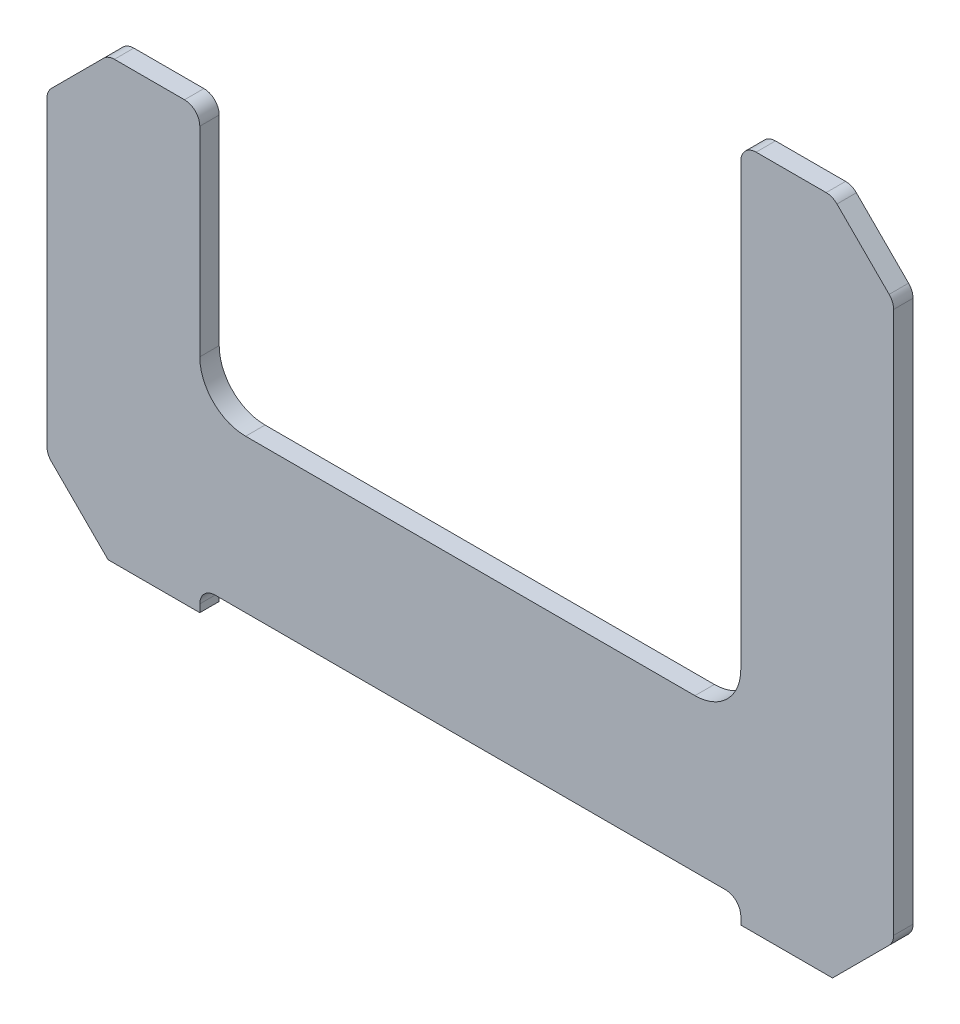
ISO-10303-21;
HEADER;
FILE_DESCRIPTION(('STEP AP214'),'2;1');
FILE_NAME('part.step','',(''),(''),'','','');
FILE_SCHEMA(('AUTOMOTIVE_DESIGN { 1 0 10303 214 1 1 1 1 }'));
ENDSEC;
DATA;
#1=APPLICATION_CONTEXT('core data for automotive mechanical design processes');
#2=APPLICATION_PROTOCOL_DEFINITION('international standard','automotive_design',2000,#1);
#3=PRODUCT_CONTEXT('',#1,'mechanical');
#4=PRODUCT('Part','Part','',(#3));
#5=PRODUCT_RELATED_PRODUCT_CATEGORY('part','',(#4));
#6=PRODUCT_DEFINITION_FORMATION('','',#4);
#7=PRODUCT_DEFINITION_CONTEXT('part definition',#1,'design');
#8=PRODUCT_DEFINITION('design','',#6,#7);
#9=PRODUCT_DEFINITION_SHAPE('','',#8);
#10=(LENGTH_UNIT() NAMED_UNIT(*) SI_UNIT(.MILLI.,.METRE.));
#11=(NAMED_UNIT(*) PLANE_ANGLE_UNIT() SI_UNIT($,.RADIAN.));
#12=(NAMED_UNIT(*) SI_UNIT($,.STERADIAN.) SOLID_ANGLE_UNIT());
#13=UNCERTAINTY_MEASURE_WITH_UNIT(LENGTH_MEASURE(1.E-05),#10,'distance_accuracy_value','');
#14=(GEOMETRIC_REPRESENTATION_CONTEXT(3) GLOBAL_UNCERTAINTY_ASSIGNED_CONTEXT((#13)) GLOBAL_UNIT_ASSIGNED_CONTEXT((#10,
#11,#12)) REPRESENTATION_CONTEXT('',''));
#15=CARTESIAN_POINT('',(0.,0.,0.));
#16=DIRECTION('',(0.,0.,1.));
#17=DIRECTION('',(1.,0.,0.));
#18=AXIS2_PLACEMENT_3D('',#15,#16,#17);
#19=CARTESIAN_POINT('',(-138.5,-57.5,-3.175));
#20=DIRECTION('',(-1.,0.,0.));
#21=DIRECTION('',(0.,0.,1.));
#22=AXIS2_PLACEMENT_3D('',#19,#20,#21);
#23=PLANE('',#22);
#24=DIRECTION('',(0.,-1.,0.));
#25=VECTOR('',#24,1.);
#26=CARTESIAN_POINT('',(-138.5,-57.5,-3.175));
#27=LINE('',#26,#25);
#28=CARTESIAN_POINT('',(-138.5,63.267387760078,-3.175));
#29=VERTEX_POINT('',#28);
#30=CARTESIAN_POINT('',(-138.5,-35.4289321881344,-3.175));
#31=VERTEX_POINT('',#30);
#32=EDGE_CURVE('E270',#29,#31,#27,.T.);
#33=ORIENTED_EDGE('',*,*,#32,.T.);
#34=DIRECTION('',(0.,0.,-1.));
#35=VECTOR('',#34,1.);
#36=CARTESIAN_POINT('',(-138.5,-35.4289321881344,-3.175));
#37=LINE('',#36,#35);
#38=CARTESIAN_POINT('',(-138.5,-35.4289321881344,3.175));
#39=VERTEX_POINT('',#38);
#40=EDGE_CURVE('E395',#31,#39,#37,.F.);
#41=ORIENTED_EDGE('',*,*,#40,.T.);
#42=DIRECTION('',(0.,-1.,0.));
#43=VECTOR('',#42,1.);
#44=CARTESIAN_POINT('',(-138.5,-57.5,3.175));
#45=LINE('',#44,#43);
#46=CARTESIAN_POINT('',(-138.5,63.267387760078,3.175));
#47=VERTEX_POINT('',#46);
#48=EDGE_CURVE('E226',#47,#39,#45,.T.);
#49=ORIENTED_EDGE('',*,*,#48,.F.);
#50=DIRECTION('',(0.,0.,1.));
#51=VECTOR('',#50,1.);
#52=CARTESIAN_POINT('',(-138.5,63.267387760078,-3.175));
#53=LINE('',#52,#51);
#54=EDGE_CURVE('E392',#47,#29,#53,.F.);
#55=ORIENTED_EDGE('',*,*,#54,.T.);
#56=EDGE_LOOP('',(#33,#41,#49,#55));
#57=FACE_BOUND('',#56,.T.);
#58=ADVANCED_FACE('F32',(#57),#23,.T.);
#59=CARTESIAN_POINT('',(-138.5,85.3384555719439,-3.175));
#60=DIRECTION('',(0.,1.,0.));
#61=DIRECTION('',(0.,0.,1.));
#62=AXIS2_PLACEMENT_3D('',#59,#60,#61);
#63=PLANE('',#62);
#64=DIRECTION('',(-1.,0.,0.));
#65=VECTOR('',#64,1.);
#66=CARTESIAN_POINT('',(-138.5,85.3384555719439,-3.175));
#67=LINE('',#66,#65);
#68=CARTESIAN_POINT('',(-93.5,85.3384555719439,-3.175));
#69=VERTEX_POINT('',#68);
#70=CARTESIAN_POINT('',(-116.428932188134,85.3384555719439,-3.175));
#71=VERTEX_POINT('',#70);
#72=EDGE_CURVE('E237',#69,#71,#67,.T.);
#73=ORIENTED_EDGE('',*,*,#72,.T.);
#74=DIRECTION('',(0.,0.,-1.));
#75=VECTOR('',#74,1.);
#76=CARTESIAN_POINT('',(-116.428932188134,85.3384555719439,-3.175));
#77=LINE('',#76,#75);
#78=CARTESIAN_POINT('',(-116.428932188134,85.3384555719439,3.175));
#79=VERTEX_POINT('',#78);
#80=EDGE_CURVE('E405',#71,#79,#77,.F.);
#81=ORIENTED_EDGE('',*,*,#80,.T.);
#82=DIRECTION('',(-1.,0.,0.));
#83=VECTOR('',#82,1.);
#84=CARTESIAN_POINT('',(-138.5,85.3384555719439,3.175));
#85=LINE('',#84,#83);
#86=CARTESIAN_POINT('',(-93.5,85.3384555719439,3.175));
#87=VERTEX_POINT('',#86);
#88=EDGE_CURVE('E268',#87,#79,#85,.T.);
#89=ORIENTED_EDGE('',*,*,#88,.F.);
#90=DIRECTION('',(0.,0.,1.));
#91=VECTOR('',#90,1.);
#92=CARTESIAN_POINT('',(-93.5,85.3384555719439,-3.175));
#93=LINE('',#92,#91);
#94=EDGE_CURVE('E403',#87,#69,#93,.F.);
#95=ORIENTED_EDGE('',*,*,#94,.T.);
#96=EDGE_LOOP('',(#73,#81,#89,#95));
#97=FACE_BOUND('',#96,.T.);
#98=ADVANCED_FACE('F514',(#97),#63,.T.);
#99=CARTESIAN_POINT('',(-88.5,85.3384555719439,-3.175));
#100=DIRECTION('',(1.,0.,0.));
#101=DIRECTION('',(0.,1.,0.));
#102=AXIS2_PLACEMENT_3D('',#99,#100,#101);
#103=PLANE('',#102);
#104=DIRECTION('',(0.,1.,0.));
#105=VECTOR('',#104,1.);
#106=CARTESIAN_POINT('',(-88.5,85.3384555719439,-3.175));
#107=LINE('',#106,#105);
#108=CARTESIAN_POINT('',(-88.5,15.,-3.175));
#109=VERTEX_POINT('',#108);
#110=CARTESIAN_POINT('',(-88.5,80.3384555719439,-3.175));
#111=VERTEX_POINT('',#110);
#112=EDGE_CURVE('E295',#109,#111,#107,.T.);
#113=ORIENTED_EDGE('',*,*,#112,.T.);
#114=DIRECTION('',(0.,0.,1.));
#115=VECTOR('',#114,1.);
#116=CARTESIAN_POINT('',(-88.5,80.3384555719439,-3.175));
#117=LINE('',#116,#115);
#118=CARTESIAN_POINT('',(-88.5,80.3384555719439,3.175));
#119=VERTEX_POINT('',#118);
#120=EDGE_CURVE('E408',#111,#119,#117,.T.);
#121=ORIENTED_EDGE('',*,*,#120,.T.);
#122=DIRECTION('',(0.,1.,0.));
#123=VECTOR('',#122,1.);
#124=CARTESIAN_POINT('',(-88.5,85.3384555719439,3.175));
#125=LINE('',#124,#123);
#126=CARTESIAN_POINT('',(-88.5,15.,3.175));
#127=VERTEX_POINT('',#126);
#128=EDGE_CURVE('E265',#127,#119,#125,.T.);
#129=ORIENTED_EDGE('',*,*,#128,.F.);
#130=DIRECTION('',(0.,0.,1.));
#131=VECTOR('',#130,1.);
#132=CARTESIAN_POINT('',(-88.5,15.,-3.175));
#133=LINE('',#132,#131);
#134=EDGE_CURVE('E334',#127,#109,#133,.F.);
#135=ORIENTED_EDGE('',*,*,#134,.T.);
#136=EDGE_LOOP('',(#113,#121,#129,#135));
#137=FACE_BOUND('',#136,.T.);
#138=ADVANCED_FACE('F505',(#137),#103,.T.);
#139=CARTESIAN_POINT('',(-88.5,0.,-3.175));
#140=DIRECTION('',(0.,1.,0.));
#141=DIRECTION('',(0.,0.,1.));
#142=AXIS2_PLACEMENT_3D('',#139,#140,#141);
#143=PLANE('',#142);
#144=DIRECTION('',(-1.,0.,0.));
#145=VECTOR('',#144,1.);
#146=CARTESIAN_POINT('',(-88.5,0.,3.175));
#147=LINE('',#146,#145);
#148=CARTESIAN_POINT('',(73.5,0.,3.175));
#149=VERTEX_POINT('',#148);
#150=CARTESIAN_POINT('',(-73.5,0.,3.175));
#151=VERTEX_POINT('',#150);
#152=EDGE_CURVE('E262',#149,#151,#147,.T.);
#153=ORIENTED_EDGE('',*,*,#152,.F.);
#154=DIRECTION('',(0.,0.,1.));
#155=VECTOR('',#154,1.);
#156=CARTESIAN_POINT('',(73.5,0.,-3.175));
#157=LINE('',#156,#155);
#158=CARTESIAN_POINT('',(73.5,0.,-3.175));
#159=VERTEX_POINT('',#158);
#160=EDGE_CURVE('E332',#149,#159,#157,.F.);
#161=ORIENTED_EDGE('',*,*,#160,.T.);
#162=DIRECTION('',(-1.,0.,0.));
#163=VECTOR('',#162,1.);
#164=CARTESIAN_POINT('',(-88.5,0.,-3.175));
#165=LINE('',#164,#163);
#166=CARTESIAN_POINT('',(-73.5,0.,-3.175));
#167=VERTEX_POINT('',#166);
#168=EDGE_CURVE('E292',#159,#167,#165,.T.);
#169=ORIENTED_EDGE('',*,*,#168,.T.);
#170=DIRECTION('',(0.,0.,1.));
#171=VECTOR('',#170,1.);
#172=CARTESIAN_POINT('',(-73.5,0.,3.175));
#173=LINE('',#172,#171);
#174=EDGE_CURVE('E329',#167,#151,#173,.T.);
#175=ORIENTED_EDGE('',*,*,#174,.T.);
#176=EDGE_LOOP('',(#153,#161,#169,#175));
#177=FACE_BOUND('',#176,.T.);
#178=ADVANCED_FACE('F496',(#177),#143,.T.);
#179=CARTESIAN_POINT('',(88.5,0.,-3.175));
#180=DIRECTION('',(-1.,0.,0.));
#181=DIRECTION('',(0.,0.,1.));
#182=AXIS2_PLACEMENT_3D('',#179,#180,#181);
#183=PLANE('',#182);
#184=DIRECTION('',(0.,-1.,0.));
#185=VECTOR('',#184,1.);
#186=CARTESIAN_POINT('',(88.5,0.,3.175));
#187=LINE('',#186,#185);
#188=CARTESIAN_POINT('',(88.5,159.,3.175));
#189=VERTEX_POINT('',#188);
#190=CARTESIAN_POINT('',(88.5,15.,3.175));
#191=VERTEX_POINT('',#190);
#192=EDGE_CURVE('E260',#189,#191,#187,.T.);
#193=ORIENTED_EDGE('',*,*,#192,.F.);
#194=DIRECTION('',(0.,0.,1.));
#195=VECTOR('',#194,1.);
#196=CARTESIAN_POINT('',(88.5,159.,-3.175));
#197=LINE('',#196,#195);
#198=CARTESIAN_POINT('',(88.5,159.,-3.175));
#199=VERTEX_POINT('',#198);
#200=EDGE_CURVE('E421',#189,#199,#197,.F.);
#201=ORIENTED_EDGE('',*,*,#200,.T.);
#202=DIRECTION('',(0.,-1.,0.));
#203=VECTOR('',#202,1.);
#204=CARTESIAN_POINT('',(88.5,0.,-3.175));
#205=LINE('',#204,#203);
#206=CARTESIAN_POINT('',(88.5,15.,-3.175));
#207=VERTEX_POINT('',#206);
#208=EDGE_CURVE('E290',#199,#207,#205,.T.);
#209=ORIENTED_EDGE('',*,*,#208,.T.);
#210=DIRECTION('',(0.,0.,1.));
#211=VECTOR('',#210,1.);
#212=CARTESIAN_POINT('',(88.5,15.,3.175));
#213=LINE('',#212,#211);
#214=EDGE_CURVE('E326',#207,#191,#213,.T.);
#215=ORIENTED_EDGE('',*,*,#214,.T.);
#216=EDGE_LOOP('',(#193,#201,#209,#215));
#217=FACE_BOUND('',#216,.T.);
#218=ADVANCED_FACE('F487',(#217),#183,.T.);
#219=CARTESIAN_POINT('',(88.5,164.,-3.175));
#220=DIRECTION('',(0.,1.,0.));
#221=DIRECTION('',(0.,0.,1.));
#222=AXIS2_PLACEMENT_3D('',#219,#220,#221);
#223=PLANE('',#222);
#224=DIRECTION('',(-1.,0.,0.));
#225=VECTOR('',#224,1.);
#226=CARTESIAN_POINT('',(88.5,164.,3.175));
#227=LINE('',#226,#225);
#228=CARTESIAN_POINT('',(116.428932188134,164.,3.175));
#229=VERTEX_POINT('',#228);
#230=CARTESIAN_POINT('',(93.5,164.,3.175));
#231=VERTEX_POINT('',#230);
#232=EDGE_CURVE('E257',#229,#231,#227,.T.);
#233=ORIENTED_EDGE('',*,*,#232,.F.);
#234=DIRECTION('',(0.,0.,1.));
#235=VECTOR('',#234,1.);
#236=CARTESIAN_POINT('',(116.428932188134,164.,-3.175));
#237=LINE('',#236,#235);
#238=CARTESIAN_POINT('',(116.428932188134,164.,-3.175));
#239=VERTEX_POINT('',#238);
#240=EDGE_CURVE('E418',#229,#239,#237,.F.);
#241=ORIENTED_EDGE('',*,*,#240,.T.);
#242=DIRECTION('',(-1.,0.,0.));
#243=VECTOR('',#242,1.);
#244=CARTESIAN_POINT('',(88.5,164.,-3.175));
#245=LINE('',#244,#243);
#246=CARTESIAN_POINT('',(93.5,164.,-3.175));
#247=VERTEX_POINT('',#246);
#248=EDGE_CURVE('E287',#239,#247,#245,.T.);
#249=ORIENTED_EDGE('',*,*,#248,.T.);
#250=DIRECTION('',(0.,0.,1.));
#251=VECTOR('',#250,1.);
#252=CARTESIAN_POINT('',(93.5,164.,-3.175));
#253=LINE('',#252,#251);
#254=EDGE_CURVE('E415',#247,#231,#253,.T.);
#255=ORIENTED_EDGE('',*,*,#254,.T.);
#256=EDGE_LOOP('',(#233,#241,#249,#255));
#257=FACE_BOUND('',#256,.T.);
#258=ADVANCED_FACE('F478',(#257),#223,.T.);
#259=CARTESIAN_POINT('',(138.5,164.,-3.175));
#260=DIRECTION('',(1.,0.,0.));
#261=DIRECTION('',(0.,1.,0.));
#262=AXIS2_PLACEMENT_3D('',#259,#260,#261);
#263=PLANE('',#262);
#264=DIRECTION('',(0.,1.,0.));
#265=VECTOR('',#264,1.);
#266=CARTESIAN_POINT('',(138.5,164.,3.175));
#267=LINE('',#266,#265);
#268=CARTESIAN_POINT('',(138.5,-35.4289321881342,3.175));
#269=VERTEX_POINT('',#268);
#270=CARTESIAN_POINT('',(138.5,141.928932188134,3.175));
#271=VERTEX_POINT('',#270);
#272=EDGE_CURVE('E254',#269,#271,#267,.T.);
#273=ORIENTED_EDGE('',*,*,#272,.F.);
#274=DIRECTION('',(0.,0.,1.));
#275=VECTOR('',#274,1.);
#276=CARTESIAN_POINT('',(138.5,-35.4289321881342,-3.175));
#277=LINE('',#276,#275);
#278=CARTESIAN_POINT('',(138.5,-35.4289321881342,-3.175));
#279=VERTEX_POINT('',#278);
#280=EDGE_CURVE('E348',#269,#279,#277,.F.);
#281=ORIENTED_EDGE('',*,*,#280,.T.);
#282=DIRECTION('',(0.,1.,0.));
#283=VECTOR('',#282,1.);
#284=CARTESIAN_POINT('',(138.5,164.,-3.175));
#285=LINE('',#284,#283);
#286=CARTESIAN_POINT('',(138.5,141.928932188134,-3.175));
#287=VERTEX_POINT('',#286);
#288=EDGE_CURVE('E284',#279,#287,#285,.T.);
#289=ORIENTED_EDGE('',*,*,#288,.T.);
#290=DIRECTION('',(0.,0.,-1.));
#291=VECTOR('',#290,1.);
#292=CARTESIAN_POINT('',(138.5,141.928932188134,-3.175));
#293=LINE('',#292,#291);
#294=EDGE_CURVE('E345',#287,#271,#293,.F.);
#295=ORIENTED_EDGE('',*,*,#294,.T.);
#296=EDGE_LOOP('',(#273,#281,#289,#295));
#297=FACE_BOUND('',#296,.T.);
#298=ADVANCED_FACE('F460',(#297),#263,.T.);
#299=CARTESIAN_POINT('',(138.5,-57.5,-3.175));
#300=DIRECTION('',(0.,-1.,0.));
#301=DIRECTION('',(1.,0.,0.));
#302=AXIS2_PLACEMENT_3D('',#299,#300,#301);
#303=PLANE('',#302);
#304=DIRECTION('',(1.,0.,0.));
#305=VECTOR('',#304,1.);
#306=CARTESIAN_POINT('',(138.5,-57.5,-3.175));
#307=LINE('',#306,#305);
#308=CARTESIAN_POINT('',(88.5,-57.5,-3.175));
#309=VERTEX_POINT('',#308);
#310=CARTESIAN_POINT('',(118.5,-57.5,-3.175));
#311=VERTEX_POINT('',#310);
#312=EDGE_CURVE('E281',#309,#311,#307,.T.);
#313=ORIENTED_EDGE('',*,*,#312,.T.);
#314=DIRECTION('',(0.,0.,1.));
#315=VECTOR('',#314,1.);
#316=CARTESIAN_POINT('',(118.5,-57.5,-3.175));
#317=LINE('',#316,#315);
#318=CARTESIAN_POINT('',(118.5,-57.5,3.175));
#319=VERTEX_POINT('',#318);
#320=EDGE_CURVE('E323',#311,#319,#317,.T.);
#321=ORIENTED_EDGE('',*,*,#320,.T.);
#322=DIRECTION('',(1.,0.,0.));
#323=VECTOR('',#322,1.);
#324=CARTESIAN_POINT('',(138.5,-57.5,3.175));
#325=LINE('',#324,#323);
#326=CARTESIAN_POINT('',(88.5,-57.5,3.175));
#327=VERTEX_POINT('',#326);
#328=EDGE_CURVE('E251',#327,#319,#325,.T.);
#329=ORIENTED_EDGE('',*,*,#328,.F.);
#330=DIRECTION('',(0.,0.,1.));
#331=VECTOR('',#330,1.);
#332=CARTESIAN_POINT('',(88.5,-57.5,-3.175));
#333=LINE('',#332,#331);
#334=EDGE_CURVE('E236',#309,#327,#333,.T.);
#335=ORIENTED_EDGE('',*,*,#334,.F.);
#336=EDGE_LOOP('',(#313,#321,#329,#335));
#337=FACE_BOUND('',#336,.T.);
#338=ADVANCED_FACE('F450',(#337),#303,.T.);
#339=CARTESIAN_POINT('',(88.5,-57.5,-3.175));
#340=DIRECTION('',(-1.,0.,0.));
#341=DIRECTION('',(0.,0.,1.));
#342=AXIS2_PLACEMENT_3D('',#339,#340,#341);
#343=PLANE('',#342);
#344=DIRECTION('',(0.,-1.,0.));
#345=VECTOR('',#344,1.);
#346=CARTESIAN_POINT('',(88.5,-57.5,3.175));
#347=LINE('',#346,#345);
#348=CARTESIAN_POINT('',(88.5,-55.,3.175));
#349=VERTEX_POINT('',#348);
#350=EDGE_CURVE('E246',#349,#327,#347,.T.);
#351=ORIENTED_EDGE('',*,*,#350,.F.);
#352=DIRECTION('',(0.,0.,1.));
#353=VECTOR('',#352,1.);
#354=CARTESIAN_POINT('',(88.5,-55.,-3.175));
#355=LINE('',#354,#353);
#356=CARTESIAN_POINT('',(88.5,-55.,-3.175));
#357=VERTEX_POINT('',#356);
#358=EDGE_CURVE('E389',#349,#357,#355,.F.);
#359=ORIENTED_EDGE('',*,*,#358,.T.);
#360=DIRECTION('',(0.,-1.,0.));
#361=VECTOR('',#360,1.);
#362=CARTESIAN_POINT('',(88.5,-57.5,-3.175));
#363=LINE('',#362,#361);
#364=EDGE_CURVE('E279',#357,#309,#363,.T.);
#365=ORIENTED_EDGE('',*,*,#364,.T.);
#366=ORIENTED_EDGE('',*,*,#334,.T.);
#367=EDGE_LOOP('',(#351,#359,#365,#366));
#368=FACE_BOUND('',#367,.T.);
#369=ADVANCED_FACE('F445',(#368),#343,.T.);
#370=CARTESIAN_POINT('',(88.5,-50.,-3.175));
#371=DIRECTION('',(0.,-1.,0.));
#372=DIRECTION('',(1.,0.,0.));
#373=AXIS2_PLACEMENT_3D('',#370,#371,#372);
#374=PLANE('',#373);
#375=DIRECTION('',(1.,0.,0.));
#376=VECTOR('',#375,1.);
#377=CARTESIAN_POINT('',(88.5,-50.,-3.175));
#378=LINE('',#377,#376);
#379=CARTESIAN_POINT('',(-83.5,-50.,-3.175));
#380=VERTEX_POINT('',#379);
#381=CARTESIAN_POINT('',(83.5,-50.,-3.175));
#382=VERTEX_POINT('',#381);
#383=EDGE_CURVE('E276',#380,#382,#378,.T.);
#384=ORIENTED_EDGE('',*,*,#383,.T.);
#385=DIRECTION('',(0.,0.,1.));
#386=VECTOR('',#385,1.);
#387=CARTESIAN_POINT('',(83.5,-50.,3.175));
#388=LINE('',#387,#386);
#389=CARTESIAN_POINT('',(83.5,-50.,3.175));
#390=VERTEX_POINT('',#389);
#391=EDGE_CURVE('E386',#382,#390,#388,.T.);
#392=ORIENTED_EDGE('',*,*,#391,.T.);
#393=DIRECTION('',(1.,0.,0.));
#394=VECTOR('',#393,1.);
#395=CARTESIAN_POINT('',(88.5,-50.,3.175));
#396=LINE('',#395,#394);
#397=CARTESIAN_POINT('',(-83.5,-50.,3.175));
#398=VERTEX_POINT('',#397);
#399=EDGE_CURVE('E243',#398,#390,#396,.T.);
#400=ORIENTED_EDGE('',*,*,#399,.F.);
#401=DIRECTION('',(0.,0.,1.));
#402=VECTOR('',#401,1.);
#403=CARTESIAN_POINT('',(-83.5,-50.,-3.175));
#404=LINE('',#403,#402);
#405=EDGE_CURVE('E384',#398,#380,#404,.F.);
#406=ORIENTED_EDGE('',*,*,#405,.T.);
#407=EDGE_LOOP('',(#384,#392,#400,#406));
#408=FACE_BOUND('',#407,.T.);
#409=ADVANCED_FACE('F430',(#408),#374,.T.);
#410=CARTESIAN_POINT('',(-88.5,-50.,-3.175));
#411=DIRECTION('',(1.,0.,0.));
#412=DIRECTION('',(0.,1.,0.));
#413=AXIS2_PLACEMENT_3D('',#410,#411,#412);
#414=PLANE('',#413);
#415=DIRECTION('',(0.,1.,0.));
#416=VECTOR('',#415,1.);
#417=CARTESIAN_POINT('',(-88.5,-50.,-3.175));
#418=LINE('',#417,#416);
#419=CARTESIAN_POINT('',(-88.5,-57.5,-3.175));
#420=VERTEX_POINT('',#419);
#421=CARTESIAN_POINT('',(-88.5,-55.,-3.175));
#422=VERTEX_POINT('',#421);
#423=EDGE_CURVE('E274',#420,#422,#418,.T.);
#424=ORIENTED_EDGE('',*,*,#423,.T.);
#425=DIRECTION('',(0.,0.,1.));
#426=VECTOR('',#425,1.);
#427=CARTESIAN_POINT('',(-88.5,-55.,3.175));
#428=LINE('',#427,#426);
#429=CARTESIAN_POINT('',(-88.5,-55.,3.175));
#430=VERTEX_POINT('',#429);
#431=EDGE_CURVE('E242',#422,#430,#428,.T.);
#432=ORIENTED_EDGE('',*,*,#431,.T.);
#433=DIRECTION('',(0.,1.,0.));
#434=VECTOR('',#433,1.);
#435=CARTESIAN_POINT('',(-88.5,-50.,3.175));
#436=LINE('',#435,#434);
#437=CARTESIAN_POINT('',(-88.5,-57.5,3.175));
#438=VERTEX_POINT('',#437);
#439=EDGE_CURVE('E221',#438,#430,#436,.T.);
#440=ORIENTED_EDGE('',*,*,#439,.F.);
#441=DIRECTION('',(0.,0.,1.));
#442=VECTOR('',#441,1.);
#443=CARTESIAN_POINT('',(-88.5,-57.5,-3.175));
#444=LINE('',#443,#442);
#445=EDGE_CURVE('E229',#420,#438,#444,.T.);
#446=ORIENTED_EDGE('',*,*,#445,.F.);
#447=EDGE_LOOP('',(#424,#432,#440,#446));
#448=FACE_BOUND('',#447,.T.);
#449=ADVANCED_FACE('F240',(#448),#414,.T.);
#450=CARTESIAN_POINT('',(-88.5,-57.5,-3.175));
#451=DIRECTION('',(0.,-1.,0.));
#452=DIRECTION('',(1.,0.,0.));
#453=AXIS2_PLACEMENT_3D('',#450,#451,#452);
#454=PLANE('',#453);
#455=DIRECTION('',(1.,0.,0.));
#456=VECTOR('',#455,1.);
#457=CARTESIAN_POINT('',(-88.5,-57.5,3.175));
#458=LINE('',#457,#456);
#459=CARTESIAN_POINT('',(-118.5,-57.5,3.175));
#460=VERTEX_POINT('',#459);
#461=EDGE_CURVE('E216',#460,#438,#458,.T.);
#462=ORIENTED_EDGE('',*,*,#461,.F.);
#463=DIRECTION('',(0.,0.,-1.));
#464=VECTOR('',#463,1.);
#465=CARTESIAN_POINT('',(-118.5,-57.5,-3.175));
#466=LINE('',#465,#464);
#467=CARTESIAN_POINT('',(-118.5,-57.5,-3.175));
#468=VERTEX_POINT('',#467);
#469=EDGE_CURVE('E310',#460,#468,#466,.T.);
#470=ORIENTED_EDGE('',*,*,#469,.T.);
#471=DIRECTION('',(1.,0.,0.));
#472=VECTOR('',#471,1.);
#473=CARTESIAN_POINT('',(-88.5,-57.5,-3.175));
#474=LINE('',#473,#472);
#475=EDGE_CURVE('E232',#468,#420,#474,.T.);
#476=ORIENTED_EDGE('',*,*,#475,.T.);
#477=ORIENTED_EDGE('',*,*,#445,.T.);
#478=EDGE_LOOP('',(#462,#470,#476,#477));
#479=FACE_BOUND('',#478,.T.);
#480=ADVANCED_FACE('F230',(#479),#454,.T.);
#481=CARTESIAN_POINT('',(0.,0.,-3.175));
#482=DIRECTION('',(0.,0.,-1.));
#483=DIRECTION('',(-1.,0.,0.));
#484=AXIS2_PLACEMENT_3D('',#481,#482,#483);
#485=PLANE('',#484);
#486=ORIENTED_EDGE('',*,*,#288,.F.);
#487=CARTESIAN_POINT('',(133.5,-35.4289321881342,-3.175));
#488=DIRECTION('',(0.,0.,-1.));
#489=DIRECTION('',(-1.,0.,0.));
#490=AXIS2_PLACEMENT_3D('',#487,#488,#489);
#491=CIRCLE('',#490,5.);
#492=CARTESIAN_POINT('',(137.035533905933,-38.9644660940669,-3.175));
#493=VERTEX_POINT('',#492);
#494=EDGE_CURVE('E365',#279,#493,#491,.T.);
#495=ORIENTED_EDGE('',*,*,#494,.T.);
#496=DIRECTION('',(0.707106781186544,0.707106781186551,0.));
#497=VECTOR('',#496,1.);
#498=CARTESIAN_POINT('',(88.0000000000006,-87.9999999999996,-3.175));
#499=LINE('',#498,#497);
#500=EDGE_CURVE('E318',#493,#311,#499,.F.);
#501=ORIENTED_EDGE('',*,*,#500,.T.);
#502=ORIENTED_EDGE('',*,*,#312,.F.);
#503=ORIENTED_EDGE('',*,*,#364,.F.);
#504=CARTESIAN_POINT('',(83.5,-55.,-3.175));
#505=DIRECTION('',(0.,0.,-1.));
#506=DIRECTION('',(-1.,0.,0.));
#507=AXIS2_PLACEMENT_3D('',#504,#505,#506);
#508=CIRCLE('',#507,5.);
#509=EDGE_CURVE('E425',#357,#382,#508,.F.);
#510=ORIENTED_EDGE('',*,*,#509,.T.);
#511=ORIENTED_EDGE('',*,*,#383,.F.);
#512=CARTESIAN_POINT('',(-83.5,-55.,-3.175));
#513=DIRECTION('',(0.,0.,-1.));
#514=DIRECTION('',(-1.,0.,0.));
#515=AXIS2_PLACEMENT_3D('',#512,#513,#514);
#516=CIRCLE('',#515,5.);
#517=EDGE_CURVE('E11',#380,#422,#516,.F.);
#518=ORIENTED_EDGE('',*,*,#517,.T.);
#519=ORIENTED_EDGE('',*,*,#423,.F.);
#520=ORIENTED_EDGE('',*,*,#475,.F.);
#521=DIRECTION('',(0.707106781186551,-0.707106781186544,0.));
#522=VECTOR('',#521,1.);
#523=CARTESIAN_POINT('',(-87.9999999999992,-88.0000000000001,-3.175));
#524=LINE('',#523,#522);
#525=CARTESIAN_POINT('',(-137.035533905933,-38.9644660940671,-3.175));
#526=VERTEX_POINT('',#525);
#527=EDGE_CURVE('E320',#468,#526,#524,.F.);
#528=ORIENTED_EDGE('',*,*,#527,.T.);
#529=CARTESIAN_POINT('',(-133.5,-35.4289321881344,-3.175));
#530=DIRECTION('',(0.,0.,-1.));
#531=DIRECTION('',(-1.,0.,0.));
#532=AXIS2_PLACEMENT_3D('',#529,#530,#531);
#533=CIRCLE('',#532,5.);
#534=EDGE_CURVE('E363',#526,#31,#533,.T.);
#535=ORIENTED_EDGE('',*,*,#534,.T.);
#536=ORIENTED_EDGE('',*,*,#32,.F.);
#537=CARTESIAN_POINT('',(-133.5,63.267387760078,-3.175));
#538=DIRECTION('',(0.,0.,-1.));
#539=DIRECTION('',(-1.,0.,0.));
#540=AXIS2_PLACEMENT_3D('',#537,#538,#539);
#541=CIRCLE('',#540,5.);
#542=CARTESIAN_POINT('',(-137.035533905933,66.8029216660108,-3.175));
#543=VERTEX_POINT('',#542);
#544=EDGE_CURVE('E361',#29,#543,#541,.T.);
#545=ORIENTED_EDGE('',*,*,#544,.T.);
#546=DIRECTION('',(-0.707106781186544,-0.707106781186551,0.));
#547=VECTOR('',#546,1.);
#548=CARTESIAN_POINT('',(-101.919227785972,101.919227785971,-3.175));
#549=LINE('',#548,#547);
#550=CARTESIAN_POINT('',(-119.964466094067,83.8739894778766,-3.175));
#551=VERTEX_POINT('',#550);
#552=EDGE_CURVE('E312',#543,#551,#549,.F.);
#553=ORIENTED_EDGE('',*,*,#552,.T.);
#554=CARTESIAN_POINT('',(-116.428932188134,80.3384555719439,-3.175));
#555=DIRECTION('',(0.,0.,-1.));
#556=DIRECTION('',(-1.,0.,0.));
#557=AXIS2_PLACEMENT_3D('',#554,#555,#556);
#558=CIRCLE('',#557,5.);
#559=EDGE_CURVE('E359',#551,#71,#558,.T.);
#560=ORIENTED_EDGE('',*,*,#559,.T.);
#561=ORIENTED_EDGE('',*,*,#72,.F.);
#562=CARTESIAN_POINT('',(-93.5,80.3384555719439,-3.175));
#563=DIRECTION('',(0.,0.,-1.));
#564=DIRECTION('',(-1.,0.,0.));
#565=AXIS2_PLACEMENT_3D('',#562,#563,#564);
#566=CIRCLE('',#565,5.);
#567=EDGE_CURVE('E357',#69,#111,#566,.T.);
#568=ORIENTED_EDGE('',*,*,#567,.T.);
#569=ORIENTED_EDGE('',*,*,#112,.F.);
#570=CARTESIAN_POINT('',(-73.5,15.,-3.175));
#571=DIRECTION('',(0.,0.,-1.));
#572=DIRECTION('',(-1.,0.,0.));
#573=AXIS2_PLACEMENT_3D('',#570,#571,#572);
#574=CIRCLE('',#573,15.);
#575=EDGE_CURVE('E343',#109,#167,#574,.F.);
#576=ORIENTED_EDGE('',*,*,#575,.T.);
#577=ORIENTED_EDGE('',*,*,#168,.F.);
#578=CARTESIAN_POINT('',(73.5,15.,-3.175));
#579=DIRECTION('',(0.,0.,-1.));
#580=DIRECTION('',(-1.,0.,0.));
#581=AXIS2_PLACEMENT_3D('',#578,#579,#580);
#582=CIRCLE('',#581,15.);
#583=EDGE_CURVE('E338',#159,#207,#582,.F.);
#584=ORIENTED_EDGE('',*,*,#583,.T.);
#585=ORIENTED_EDGE('',*,*,#208,.F.);
#586=CARTESIAN_POINT('',(93.5,159.,-3.175));
#587=DIRECTION('',(0.,0.,-1.));
#588=DIRECTION('',(-1.,0.,0.));
#589=AXIS2_PLACEMENT_3D('',#586,#587,#588);
#590=CIRCLE('',#589,5.);
#591=EDGE_CURVE('E351',#199,#247,#590,.T.);
#592=ORIENTED_EDGE('',*,*,#591,.T.);
#593=ORIENTED_EDGE('',*,*,#248,.F.);
#594=CARTESIAN_POINT('',(116.428932188134,159.,-3.175));
#595=DIRECTION('',(0.,0.,-1.));
#596=DIRECTION('',(-1.,0.,0.));
#597=AXIS2_PLACEMENT_3D('',#594,#595,#596);
#598=CIRCLE('',#597,5.);
#599=CARTESIAN_POINT('',(119.964466094067,162.535533905933,-3.175));
#600=VERTEX_POINT('',#599);
#601=EDGE_CURVE('E353',#239,#600,#598,.T.);
#602=ORIENTED_EDGE('',*,*,#601,.T.);
#603=DIRECTION('',(-0.707106781186551,0.707106781186544,0.));
#604=VECTOR('',#603,1.);
#605=CARTESIAN_POINT('',(141.249999999999,141.250000000001,-3.175));
#606=LINE('',#605,#604);
#607=CARTESIAN_POINT('',(137.035533905933,145.464466094067,-3.175));
#608=VERTEX_POINT('',#607);
#609=EDGE_CURVE('E315',#600,#608,#606,.F.);
#610=ORIENTED_EDGE('',*,*,#609,.T.);
#611=CARTESIAN_POINT('',(133.5,141.928932188134,-3.175));
#612=DIRECTION('',(0.,0.,-1.));
#613=DIRECTION('',(-1.,0.,0.));
#614=AXIS2_PLACEMENT_3D('',#611,#612,#613);
#615=CIRCLE('',#614,5.);
#616=EDGE_CURVE('E355',#608,#287,#615,.T.);
#617=ORIENTED_EDGE('',*,*,#616,.T.);
#618=EDGE_LOOP('',(#486,#495,#501,#502,#503,#510,#511,#518,#519,#520,#528,#535,#536,#545,#553,
#560,#561,#568,#569,#576,#577,#584,#585,#592,#593,#602,#610,#617));
#619=FACE_BOUND('',#618,.T.);
#620=ADVANCED_FACE('F437',(#619),#485,.T.);
#621=CARTESIAN_POINT('',(0.,0.,3.175));
#622=DIRECTION('',(0.,0.,-1.));
#623=DIRECTION('',(-1.,0.,0.));
#624=AXIS2_PLACEMENT_3D('',#621,#622,#623);
#625=PLANE('',#624);
#626=DIRECTION('',(-0.707106781186544,-0.707106781186551,0.));
#627=VECTOR('',#626,1.);
#628=CARTESIAN_POINT('',(118.5,-57.5,3.175));
#629=LINE('',#628,#627);
#630=CARTESIAN_POINT('',(137.035533905933,-38.9644660940669,3.175));
#631=VERTEX_POINT('',#630);
#632=EDGE_CURVE('E307',#319,#631,#629,.F.);
#633=ORIENTED_EDGE('',*,*,#632,.T.);
#634=CARTESIAN_POINT('',(133.5,-35.4289321881342,3.175));
#635=DIRECTION('',(0.,0.,-1.));
#636=DIRECTION('',(-1.,0.,0.));
#637=AXIS2_PLACEMENT_3D('',#634,#635,#636);
#638=CIRCLE('',#637,5.);
#639=EDGE_CURVE('E382',#631,#269,#638,.F.);
#640=ORIENTED_EDGE('',*,*,#639,.T.);
#641=ORIENTED_EDGE('',*,*,#272,.T.);
#642=CARTESIAN_POINT('',(133.5,141.928932188134,3.175));
#643=DIRECTION('',(0.,0.,-1.));
#644=DIRECTION('',(-1.,0.,0.));
#645=AXIS2_PLACEMENT_3D('',#642,#643,#644);
#646=CIRCLE('',#645,5.);
#647=CARTESIAN_POINT('',(137.035533905933,145.464466094067,3.175));
#648=VERTEX_POINT('',#647);
#649=EDGE_CURVE('E373',#271,#648,#646,.F.);
#650=ORIENTED_EDGE('',*,*,#649,.T.);
#651=DIRECTION('',(0.707106781186551,-0.707106781186544,0.));
#652=VECTOR('',#651,1.);
#653=CARTESIAN_POINT('',(138.5,144.,3.175));
#654=LINE('',#653,#652);
#655=CARTESIAN_POINT('',(119.964466094067,162.535533905933,3.175));
#656=VERTEX_POINT('',#655);
#657=EDGE_CURVE('E304',#648,#656,#654,.F.);
#658=ORIENTED_EDGE('',*,*,#657,.T.);
#659=CARTESIAN_POINT('',(116.428932188134,159.,3.175));
#660=DIRECTION('',(0.,0.,-1.));
#661=DIRECTION('',(-1.,0.,0.));
#662=AXIS2_PLACEMENT_3D('',#659,#660,#661);
#663=CIRCLE('',#662,5.);
#664=EDGE_CURVE('E371',#656,#229,#663,.F.);
#665=ORIENTED_EDGE('',*,*,#664,.T.);
#666=ORIENTED_EDGE('',*,*,#232,.T.);
#667=CARTESIAN_POINT('',(93.5,159.,3.175));
#668=DIRECTION('',(0.,0.,-1.));
#669=DIRECTION('',(-1.,0.,0.));
#670=AXIS2_PLACEMENT_3D('',#667,#668,#669);
#671=CIRCLE('',#670,5.);
#672=EDGE_CURVE('E369',#231,#189,#671,.F.);
#673=ORIENTED_EDGE('',*,*,#672,.T.);
#674=ORIENTED_EDGE('',*,*,#192,.T.);
#675=CARTESIAN_POINT('',(73.5,15.,3.175));
#676=DIRECTION('',(0.,0.,-1.));
#677=DIRECTION('',(-1.,0.,0.));
#678=AXIS2_PLACEMENT_3D('',#675,#676,#677);
#679=CIRCLE('',#678,15.);
#680=EDGE_CURVE('E336',#191,#149,#679,.T.);
#681=ORIENTED_EDGE('',*,*,#680,.T.);
#682=ORIENTED_EDGE('',*,*,#152,.T.);
#683=CARTESIAN_POINT('',(-73.5,15.,3.175));
#684=DIRECTION('',(0.,0.,-1.));
#685=DIRECTION('',(-1.,0.,0.));
#686=AXIS2_PLACEMENT_3D('',#683,#684,#685);
#687=CIRCLE('',#686,15.);
#688=EDGE_CURVE('E341',#151,#127,#687,.T.);
#689=ORIENTED_EDGE('',*,*,#688,.T.);
#690=ORIENTED_EDGE('',*,*,#128,.T.);
#691=CARTESIAN_POINT('',(-93.5,80.3384555719439,3.175));
#692=DIRECTION('',(0.,0.,-1.));
#693=DIRECTION('',(-1.,0.,0.));
#694=AXIS2_PLACEMENT_3D('',#691,#692,#693);
#695=CIRCLE('',#694,5.);
#696=EDGE_CURVE('E375',#119,#87,#695,.F.);
#697=ORIENTED_EDGE('',*,*,#696,.T.);
#698=ORIENTED_EDGE('',*,*,#88,.T.);
#699=CARTESIAN_POINT('',(-116.428932188134,80.3384555719439,3.175));
#700=DIRECTION('',(0.,0.,-1.));
#701=DIRECTION('',(-1.,0.,0.));
#702=AXIS2_PLACEMENT_3D('',#699,#700,#701);
#703=CIRCLE('',#702,5.);
#704=CARTESIAN_POINT('',(-119.964466094067,83.8739894778766,3.175));
#705=VERTEX_POINT('',#704);
#706=EDGE_CURVE('E54',#79,#705,#703,.F.);
#707=ORIENTED_EDGE('',*,*,#706,.T.);
#708=DIRECTION('',(0.707106781186544,0.707106781186551,0.));
#709=VECTOR('',#708,1.);
#710=CARTESIAN_POINT('',(-118.5,85.3384555719439,3.175));
#711=LINE('',#710,#709);
#712=CARTESIAN_POINT('',(-137.035533905933,66.8029216660108,3.175));
#713=VERTEX_POINT('',#712);
#714=EDGE_CURVE('E301',#705,#713,#711,.F.);
#715=ORIENTED_EDGE('',*,*,#714,.T.);
#716=CARTESIAN_POINT('',(-133.5,63.267387760078,3.175));
#717=DIRECTION('',(0.,0.,-1.));
#718=DIRECTION('',(-1.,0.,0.));
#719=AXIS2_PLACEMENT_3D('',#716,#717,#718);
#720=CIRCLE('',#719,5.);
#721=EDGE_CURVE('E378',#713,#47,#720,.F.);
#722=ORIENTED_EDGE('',*,*,#721,.T.);
#723=ORIENTED_EDGE('',*,*,#48,.T.);
#724=CARTESIAN_POINT('',(-133.5,-35.4289321881344,3.175));
#725=DIRECTION('',(0.,0.,-1.));
#726=DIRECTION('',(-1.,0.,0.));
#727=AXIS2_PLACEMENT_3D('',#724,#725,#726);
#728=CIRCLE('',#727,5.);
#729=CARTESIAN_POINT('',(-137.035533905933,-38.9644660940672,3.175));
#730=VERTEX_POINT('',#729);
#731=EDGE_CURVE('E380',#39,#730,#728,.F.);
#732=ORIENTED_EDGE('',*,*,#731,.T.);
#733=DIRECTION('',(-0.707106781186551,0.707106781186544,0.));
#734=VECTOR('',#733,1.);
#735=CARTESIAN_POINT('',(-138.5,-37.4999999999999,3.175));
#736=LINE('',#735,#734);
#737=EDGE_CURVE('E223',#730,#460,#736,.F.);
#738=ORIENTED_EDGE('',*,*,#737,.T.);
#739=ORIENTED_EDGE('',*,*,#461,.T.);
#740=ORIENTED_EDGE('',*,*,#439,.T.);
#741=CARTESIAN_POINT('',(-83.5,-55.,3.175));
#742=DIRECTION('',(0.,0.,-1.));
#743=DIRECTION('',(-1.,0.,0.));
#744=AXIS2_PLACEMENT_3D('',#741,#742,#743);
#745=CIRCLE('',#744,5.);
#746=EDGE_CURVE('E40',#430,#398,#745,.T.);
#747=ORIENTED_EDGE('',*,*,#746,.T.);
#748=ORIENTED_EDGE('',*,*,#399,.T.);
#749=CARTESIAN_POINT('',(83.5,-55.,3.175));
#750=DIRECTION('',(0.,0.,-1.));
#751=DIRECTION('',(-1.,0.,0.));
#752=AXIS2_PLACEMENT_3D('',#749,#750,#751);
#753=CIRCLE('',#752,5.);
#754=EDGE_CURVE('E423',#390,#349,#753,.T.);
#755=ORIENTED_EDGE('',*,*,#754,.T.);
#756=ORIENTED_EDGE('',*,*,#350,.T.);
#757=ORIENTED_EDGE('',*,*,#328,.T.);
#758=EDGE_LOOP('',(#633,#640,#641,#650,#658,#665,#666,#673,#674,#681,#682,#689,#690,#697,#698,
#707,#715,#722,#723,#732,#738,#739,#740,#747,#748,#755,#756,#757));
#759=FACE_BOUND('',#758,.T.);
#760=ADVANCED_FACE('F219',(#759),#625,.F.);
#761=CARTESIAN_POINT('',(-138.5,-37.4999999999999,-3.175));
#762=DIRECTION('',(0.707106781186544,0.707106781186551,0.));
#763=DIRECTION('',(0.,0.,1.));
#764=AXIS2_PLACEMENT_3D('',#761,#762,#763);
#765=PLANE('',#764);
#766=ORIENTED_EDGE('',*,*,#737,.F.);
#767=DIRECTION('',(0.,0.,1.));
#768=VECTOR('',#767,1.);
#769=CARTESIAN_POINT('',(-137.035533905933,-38.9644660940672,-3.175));
#770=LINE('',#769,#768);
#771=EDGE_CURVE('E398',#730,#526,#770,.F.);
#772=ORIENTED_EDGE('',*,*,#771,.T.);
#773=ORIENTED_EDGE('',*,*,#527,.F.);
#774=ORIENTED_EDGE('',*,*,#469,.F.);
#775=EDGE_LOOP('',(#766,#772,#773,#774));
#776=FACE_BOUND('',#775,.T.);
#777=ADVANCED_FACE('F534',(#776),#765,.F.);
#778=CARTESIAN_POINT('',(118.5,-57.5,-3.175));
#779=DIRECTION('',(-0.707106781186551,0.707106781186544,0.));
#780=DIRECTION('',(0.,0.,1.));
#781=AXIS2_PLACEMENT_3D('',#778,#779,#780);
#782=PLANE('',#781);
#783=ORIENTED_EDGE('',*,*,#500,.F.);
#784=DIRECTION('',(0.,0.,-1.));
#785=VECTOR('',#784,1.);
#786=CARTESIAN_POINT('',(137.035533905933,-38.9644660940669,-3.175));
#787=LINE('',#786,#785);
#788=EDGE_CURVE('E367',#493,#631,#787,.F.);
#789=ORIENTED_EDGE('',*,*,#788,.T.);
#790=ORIENTED_EDGE('',*,*,#632,.F.);
#791=ORIENTED_EDGE('',*,*,#320,.F.);
#792=EDGE_LOOP('',(#783,#789,#790,#791));
#793=FACE_BOUND('',#792,.T.);
#794=ADVANCED_FACE('F557',(#793),#782,.F.);
#795=CARTESIAN_POINT('',(138.5,144.,-3.175));
#796=DIRECTION('',(-0.707106781186544,-0.707106781186551,0.));
#797=DIRECTION('',(0.,0.,1.));
#798=AXIS2_PLACEMENT_3D('',#795,#796,#797);
#799=PLANE('',#798);
#800=ORIENTED_EDGE('',*,*,#657,.F.);
#801=DIRECTION('',(0.,0.,1.));
#802=VECTOR('',#801,1.);
#803=CARTESIAN_POINT('',(137.035533905933,145.464466094067,-3.175));
#804=LINE('',#803,#802);
#805=EDGE_CURVE('E413',#648,#608,#804,.F.);
#806=ORIENTED_EDGE('',*,*,#805,.T.);
#807=ORIENTED_EDGE('',*,*,#609,.F.);
#808=DIRECTION('',(0.,0.,-1.));
#809=VECTOR('',#808,1.);
#810=CARTESIAN_POINT('',(119.964466094067,162.535533905933,-3.175));
#811=LINE('',#810,#809);
#812=EDGE_CURVE('E411',#600,#656,#811,.F.);
#813=ORIENTED_EDGE('',*,*,#812,.T.);
#814=EDGE_LOOP('',(#800,#806,#807,#813));
#815=FACE_BOUND('',#814,.T.);
#816=ADVANCED_FACE('F471',(#815),#799,.F.);
#817=CARTESIAN_POINT('',(-118.5,85.3384555719439,-3.175));
#818=DIRECTION('',(0.707106781186551,-0.707106781186544,0.));
#819=DIRECTION('',(0.,0.,1.));
#820=AXIS2_PLACEMENT_3D('',#817,#818,#819);
#821=PLANE('',#820);
#822=ORIENTED_EDGE('',*,*,#552,.F.);
#823=DIRECTION('',(0.,0.,-1.));
#824=VECTOR('',#823,1.);
#825=CARTESIAN_POINT('',(-137.035533905933,66.8029216660108,-3.175));
#826=LINE('',#825,#824);
#827=EDGE_CURVE('E47',#543,#713,#826,.F.);
#828=ORIENTED_EDGE('',*,*,#827,.T.);
#829=ORIENTED_EDGE('',*,*,#714,.F.);
#830=DIRECTION('',(0.,0.,1.));
#831=VECTOR('',#830,1.);
#832=CARTESIAN_POINT('',(-119.964466094067,83.8739894778766,-3.175));
#833=LINE('',#832,#831);
#834=EDGE_CURVE('E400',#705,#551,#833,.F.);
#835=ORIENTED_EDGE('',*,*,#834,.T.);
#836=EDGE_LOOP('',(#822,#828,#829,#835));
#837=FACE_BOUND('',#836,.T.);
#838=ADVANCED_FACE('F521',(#837),#821,.F.);
#839=CARTESIAN_POINT('',(73.5,15.,-3.175));
#840=DIRECTION('',(0.,0.,-1.));
#841=DIRECTION('',(-1.,0.,0.));
#842=AXIS2_PLACEMENT_3D('',#839,#840,#841);
#843=CYLINDRICAL_SURFACE('',#842,15.);
#844=ORIENTED_EDGE('',*,*,#583,.F.);
#845=ORIENTED_EDGE('',*,*,#160,.F.);
#846=ORIENTED_EDGE('',*,*,#680,.F.);
#847=ORIENTED_EDGE('',*,*,#214,.F.);
#848=EDGE_LOOP('',(#844,#845,#846,#847));
#849=FACE_BOUND('',#848,.T.);
#850=ADVANCED_FACE('F492',(#849),#843,.F.);
#851=CARTESIAN_POINT('',(-73.5,15.,-3.175));
#852=DIRECTION('',(0.,0.,-1.));
#853=DIRECTION('',(-1.,0.,0.));
#854=AXIS2_PLACEMENT_3D('',#851,#852,#853);
#855=CYLINDRICAL_SURFACE('',#854,15.);
#856=ORIENTED_EDGE('',*,*,#575,.F.);
#857=ORIENTED_EDGE('',*,*,#134,.F.);
#858=ORIENTED_EDGE('',*,*,#688,.F.);
#859=ORIENTED_EDGE('',*,*,#174,.F.);
#860=EDGE_LOOP('',(#856,#857,#858,#859));
#861=FACE_BOUND('',#860,.T.);
#862=ADVANCED_FACE('F501',(#861),#855,.F.);
#863=CARTESIAN_POINT('',(133.5,-35.4289321881342,-3.175));
#864=DIRECTION('',(0.,0.,1.));
#865=DIRECTION('',(1.,0.,0.));
#866=AXIS2_PLACEMENT_3D('',#863,#864,#865);
#867=CYLINDRICAL_SURFACE('',#866,5.);
#868=ORIENTED_EDGE('',*,*,#639,.F.);
#869=ORIENTED_EDGE('',*,*,#788,.F.);
#870=ORIENTED_EDGE('',*,*,#494,.F.);
#871=ORIENTED_EDGE('',*,*,#280,.F.);
#872=EDGE_LOOP('',(#868,#869,#870,#871));
#873=FACE_BOUND('',#872,.T.);
#874=ADVANCED_FACE('F458',(#873),#867,.T.);
#875=CARTESIAN_POINT('',(83.5,-55.,-3.175));
#876=DIRECTION('',(0.,0.,-1.));
#877=DIRECTION('',(-1.,0.,0.));
#878=AXIS2_PLACEMENT_3D('',#875,#876,#877);
#879=CYLINDRICAL_SURFACE('',#878,5.);
#880=ORIENTED_EDGE('',*,*,#509,.F.);
#881=ORIENTED_EDGE('',*,*,#358,.F.);
#882=ORIENTED_EDGE('',*,*,#754,.F.);
#883=ORIENTED_EDGE('',*,*,#391,.F.);
#884=EDGE_LOOP('',(#880,#881,#882,#883));
#885=FACE_BOUND('',#884,.T.);
#886=ADVANCED_FACE('F441',(#885),#879,.F.);
#887=CARTESIAN_POINT('',(-83.5,-55.,-3.175));
#888=DIRECTION('',(0.,0.,-1.));
#889=DIRECTION('',(-1.,0.,0.));
#890=AXIS2_PLACEMENT_3D('',#887,#888,#889);
#891=CYLINDRICAL_SURFACE('',#890,5.);
#892=ORIENTED_EDGE('',*,*,#517,.F.);
#893=ORIENTED_EDGE('',*,*,#405,.F.);
#894=ORIENTED_EDGE('',*,*,#746,.F.);
#895=ORIENTED_EDGE('',*,*,#431,.F.);
#896=EDGE_LOOP('',(#892,#893,#894,#895));
#897=FACE_BOUND('',#896,.T.);
#898=ADVANCED_FACE('F434',(#897),#891,.F.);
#899=CARTESIAN_POINT('',(-133.5,-35.4289321881344,-3.175));
#900=DIRECTION('',(0.,0.,-1.));
#901=DIRECTION('',(-1.,0.,0.));
#902=AXIS2_PLACEMENT_3D('',#899,#900,#901);
#903=CYLINDRICAL_SURFACE('',#902,5.);
#904=ORIENTED_EDGE('',*,*,#534,.F.);
#905=ORIENTED_EDGE('',*,*,#771,.F.);
#906=ORIENTED_EDGE('',*,*,#731,.F.);
#907=ORIENTED_EDGE('',*,*,#40,.F.);
#908=EDGE_LOOP('',(#904,#905,#906,#907));
#909=FACE_BOUND('',#908,.T.);
#910=ADVANCED_FACE('F537',(#909),#903,.T.);
#911=CARTESIAN_POINT('',(-133.5,63.267387760078,-3.175));
#912=DIRECTION('',(0.,0.,1.));
#913=DIRECTION('',(1.,0.,0.));
#914=AXIS2_PLACEMENT_3D('',#911,#912,#913);
#915=CYLINDRICAL_SURFACE('',#914,5.);
#916=ORIENTED_EDGE('',*,*,#721,.F.);
#917=ORIENTED_EDGE('',*,*,#827,.F.);
#918=ORIENTED_EDGE('',*,*,#544,.F.);
#919=ORIENTED_EDGE('',*,*,#54,.F.);
#920=EDGE_LOOP('',(#916,#917,#918,#919));
#921=FACE_BOUND('',#920,.T.);
#922=ADVANCED_FACE('F526',(#921),#915,.T.);
#923=CARTESIAN_POINT('',(-116.428932188134,80.3384555719439,-3.175));
#924=DIRECTION('',(0.,0.,-1.));
#925=DIRECTION('',(-1.,0.,0.));
#926=AXIS2_PLACEMENT_3D('',#923,#924,#925);
#927=CYLINDRICAL_SURFACE('',#926,5.);
#928=ORIENTED_EDGE('',*,*,#559,.F.);
#929=ORIENTED_EDGE('',*,*,#834,.F.);
#930=ORIENTED_EDGE('',*,*,#706,.F.);
#931=ORIENTED_EDGE('',*,*,#80,.F.);
#932=EDGE_LOOP('',(#928,#929,#930,#931));
#933=FACE_BOUND('',#932,.T.);
#934=ADVANCED_FACE('F519',(#933),#927,.T.);
#935=CARTESIAN_POINT('',(-93.5,80.3384555719439,-3.175));
#936=DIRECTION('',(0.,0.,1.));
#937=DIRECTION('',(1.,0.,0.));
#938=AXIS2_PLACEMENT_3D('',#935,#936,#937);
#939=CYLINDRICAL_SURFACE('',#938,5.);
#940=ORIENTED_EDGE('',*,*,#567,.F.);
#941=ORIENTED_EDGE('',*,*,#94,.F.);
#942=ORIENTED_EDGE('',*,*,#696,.F.);
#943=ORIENTED_EDGE('',*,*,#120,.F.);
#944=EDGE_LOOP('',(#940,#941,#942,#943));
#945=FACE_BOUND('',#944,.T.);
#946=ADVANCED_FACE('F510',(#945),#939,.T.);
#947=CARTESIAN_POINT('',(133.5,141.928932188134,-3.175));
#948=DIRECTION('',(0.,0.,-1.));
#949=DIRECTION('',(-1.,0.,0.));
#950=AXIS2_PLACEMENT_3D('',#947,#948,#949);
#951=CYLINDRICAL_SURFACE('',#950,5.);
#952=ORIENTED_EDGE('',*,*,#616,.F.);
#953=ORIENTED_EDGE('',*,*,#805,.F.);
#954=ORIENTED_EDGE('',*,*,#649,.F.);
#955=ORIENTED_EDGE('',*,*,#294,.F.);
#956=EDGE_LOOP('',(#952,#953,#954,#955));
#957=FACE_BOUND('',#956,.T.);
#958=ADVANCED_FACE('F467',(#957),#951,.T.);
#959=CARTESIAN_POINT('',(116.428932188134,159.,-3.175));
#960=DIRECTION('',(0.,0.,1.));
#961=DIRECTION('',(1.,0.,0.));
#962=AXIS2_PLACEMENT_3D('',#959,#960,#961);
#963=CYLINDRICAL_SURFACE('',#962,5.);
#964=ORIENTED_EDGE('',*,*,#664,.F.);
#965=ORIENTED_EDGE('',*,*,#812,.F.);
#966=ORIENTED_EDGE('',*,*,#601,.F.);
#967=ORIENTED_EDGE('',*,*,#240,.F.);
#968=EDGE_LOOP('',(#964,#965,#966,#967));
#969=FACE_BOUND('',#968,.T.);
#970=ADVANCED_FACE('F474',(#969),#963,.T.);
#971=CARTESIAN_POINT('',(93.5,159.,-3.175));
#972=DIRECTION('',(0.,0.,1.));
#973=DIRECTION('',(1.,0.,0.));
#974=AXIS2_PLACEMENT_3D('',#971,#972,#973);
#975=CYLINDRICAL_SURFACE('',#974,5.);
#976=ORIENTED_EDGE('',*,*,#591,.F.);
#977=ORIENTED_EDGE('',*,*,#200,.F.);
#978=ORIENTED_EDGE('',*,*,#672,.F.);
#979=ORIENTED_EDGE('',*,*,#254,.F.);
#980=EDGE_LOOP('',(#976,#977,#978,#979));
#981=FACE_BOUND('',#980,.T.);
#982=ADVANCED_FACE('F34',(#981),#975,.T.);
#983=CLOSED_SHELL('',(#58,#98,#138,#178,#218,#258,#298,#338,#369,#409,#449,#480,#620,#760,#777,
#794,#816,#838,#850,#862,#874,#886,#898,#910,#922,#934,#946,#958,#970,#982));
#984=MANIFOLD_SOLID_BREP('B2',#983);
#985=ADVANCED_BREP_SHAPE_REPRESENTATION('',(#18,#984),#14);
#986=SHAPE_DEFINITION_REPRESENTATION(#9,#985);
ENDSEC;
END-ISO-10303-21;
